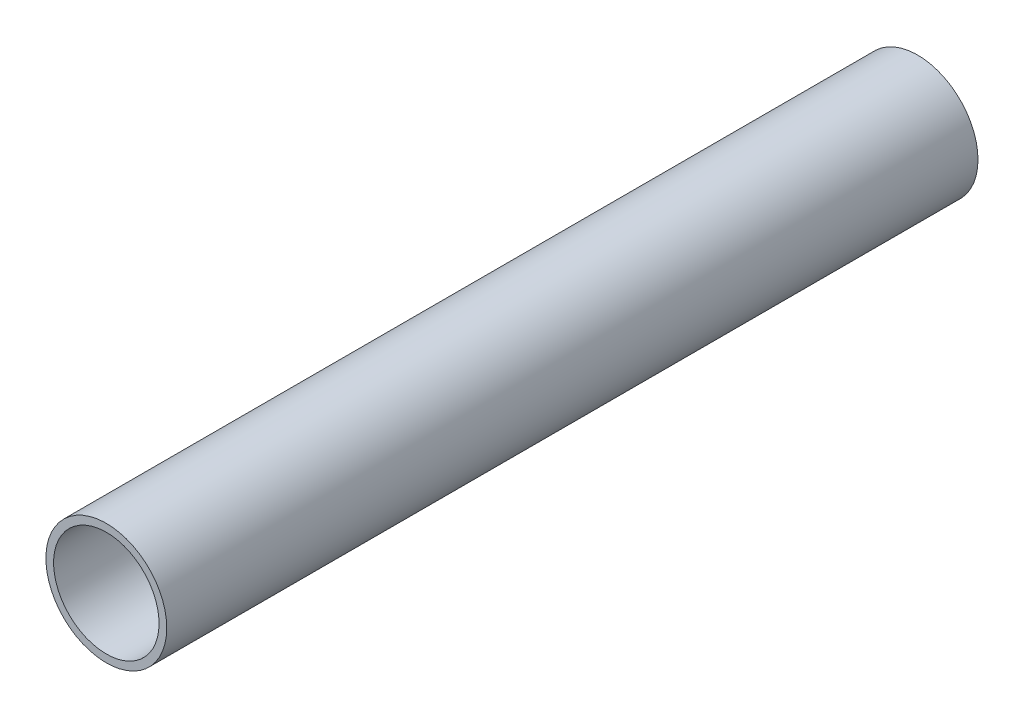
ISO-10303-21;
HEADER;
FILE_DESCRIPTION(('STEP AP214'),'2;1');
FILE_NAME('part.step','',(''),(''),'','','');
FILE_SCHEMA(('AUTOMOTIVE_DESIGN { 1 0 10303 214 1 1 1 1 }'));
ENDSEC;
DATA;
#1=APPLICATION_CONTEXT('core data for automotive mechanical design processes');
#2=APPLICATION_PROTOCOL_DEFINITION('international standard','automotive_design',2000,#1);
#3=PRODUCT_CONTEXT('',#1,'mechanical');
#4=PRODUCT('Part','Part','',(#3));
#5=PRODUCT_RELATED_PRODUCT_CATEGORY('part','',(#4));
#6=PRODUCT_DEFINITION_FORMATION('','',#4);
#7=PRODUCT_DEFINITION_CONTEXT('part definition',#1,'design');
#8=PRODUCT_DEFINITION('design','',#6,#7);
#9=PRODUCT_DEFINITION_SHAPE('','',#8);
#10=(LENGTH_UNIT() NAMED_UNIT(*) SI_UNIT(.MILLI.,.METRE.));
#11=(NAMED_UNIT(*) PLANE_ANGLE_UNIT() SI_UNIT($,.RADIAN.));
#12=(NAMED_UNIT(*) SI_UNIT($,.STERADIAN.) SOLID_ANGLE_UNIT());
#13=UNCERTAINTY_MEASURE_WITH_UNIT(LENGTH_MEASURE(1.E-05),#10,'distance_accuracy_value','');
#14=(GEOMETRIC_REPRESENTATION_CONTEXT(3) GLOBAL_UNCERTAINTY_ASSIGNED_CONTEXT((#13)) GLOBAL_UNIT_ASSIGNED_CONTEXT((#10,
#11,#12)) REPRESENTATION_CONTEXT('',''));
#15=CARTESIAN_POINT('',(0.,0.,0.));
#16=DIRECTION('',(0.,0.,1.));
#17=DIRECTION('',(1.,0.,0.));
#18=AXIS2_PLACEMENT_3D('',#15,#16,#17);
#19=CARTESIAN_POINT('',(0.,0.,254.));
#20=DIRECTION('',(0.,0.,1.));
#21=DIRECTION('',(1.,0.,0.));
#22=AXIS2_PLACEMENT_3D('',#19,#20,#21);
#23=PLANE('',#22);
#24=CARTESIAN_POINT('',(0.,0.,254.));
#25=DIRECTION('',(0.,0.,1.));
#26=DIRECTION('',(1.,0.,0.));
#27=AXIS2_PLACEMENT_3D('',#24,#25,#26);
#28=CIRCLE('',#27,18.923);
#29=CARTESIAN_POINT('',(18.923,0.,254.));
#30=VERTEX_POINT('',#29);
#31=EDGE_CURVE('E10',#30,#30,#28,.T.);
#32=ORIENTED_EDGE('',*,*,#31,.T.);
#33=EDGE_LOOP('',(#32));
#34=FACE_BOUND('',#33,.T.);
#35=CARTESIAN_POINT('',(0.,0.,254.));
#36=DIRECTION('',(0.,0.,1.));
#37=DIRECTION('',(1.,0.,0.));
#38=AXIS2_PLACEMENT_3D('',#35,#36,#37);
#39=CIRCLE('',#38,16.51);
#40=CARTESIAN_POINT('',(16.51,0.,254.));
#41=VERTEX_POINT('',#40);
#42=EDGE_CURVE('E42',#41,#41,#39,.T.);
#43=ORIENTED_EDGE('',*,*,#42,.F.);
#44=EDGE_LOOP('',(#43));
#45=FACE_BOUND('',#44,.T.);
#46=ADVANCED_FACE('F31',(#34,#45),#23,.T.);
#47=CARTESIAN_POINT('',(0.,0.,0.));
#48=DIRECTION('',(0.,0.,1.));
#49=DIRECTION('',(1.,0.,0.));
#50=AXIS2_PLACEMENT_3D('',#47,#48,#49);
#51=PLANE('',#50);
#52=CARTESIAN_POINT('',(0.,0.,0.));
#53=DIRECTION('',(0.,0.,1.));
#54=DIRECTION('',(1.,0.,0.));
#55=AXIS2_PLACEMENT_3D('',#52,#53,#54);
#56=CIRCLE('',#55,18.923);
#57=CARTESIAN_POINT('',(18.923,0.,0.));
#58=VERTEX_POINT('',#57);
#59=EDGE_CURVE('E35',#58,#58,#56,.T.);
#60=ORIENTED_EDGE('',*,*,#59,.F.);
#61=EDGE_LOOP('',(#60));
#62=FACE_BOUND('',#61,.T.);
#63=CARTESIAN_POINT('',(0.,0.,0.));
#64=DIRECTION('',(0.,0.,1.));
#65=DIRECTION('',(1.,0.,0.));
#66=AXIS2_PLACEMENT_3D('',#63,#64,#65);
#67=CIRCLE('',#66,16.51);
#68=CARTESIAN_POINT('',(16.51,0.,0.));
#69=VERTEX_POINT('',#68);
#70=EDGE_CURVE('E44',#69,#69,#67,.T.);
#71=ORIENTED_EDGE('',*,*,#70,.T.);
#72=EDGE_LOOP('',(#71));
#73=FACE_BOUND('',#72,.T.);
#74=ADVANCED_FACE('F54',(#62,#73),#51,.F.);
#75=CARTESIAN_POINT('',(0.,0.,254.));
#76=DIRECTION('',(0.,0.,-1.));
#77=DIRECTION('',(-1.,0.,0.));
#78=AXIS2_PLACEMENT_3D('',#75,#76,#77);
#79=CYLINDRICAL_SURFACE('',#78,18.923);
#80=ORIENTED_EDGE('',*,*,#31,.F.);
#81=EDGE_LOOP('',(#80));
#82=FACE_BOUND('',#81,.T.);
#83=ORIENTED_EDGE('',*,*,#59,.T.);
#84=EDGE_LOOP('',(#83));
#85=FACE_BOUND('',#84,.T.);
#86=ADVANCED_FACE('F33',(#82,#85),#79,.T.);
#87=CARTESIAN_POINT('',(0.,0.,254.));
#88=DIRECTION('',(0.,0.,-1.));
#89=DIRECTION('',(-1.,0.,0.));
#90=AXIS2_PLACEMENT_3D('',#87,#88,#89);
#91=CYLINDRICAL_SURFACE('',#90,16.51);
#92=ORIENTED_EDGE('',*,*,#42,.T.);
#93=EDGE_LOOP('',(#92));
#94=FACE_BOUND('',#93,.T.);
#95=ORIENTED_EDGE('',*,*,#70,.F.);
#96=EDGE_LOOP('',(#95));
#97=FACE_BOUND('',#96,.T.);
#98=ADVANCED_FACE('F50',(#94,#97),#91,.F.);
#99=CLOSED_SHELL('',(#46,#74,#86,#98));
#100=MANIFOLD_SOLID_BREP('B2',#99);
#101=ADVANCED_BREP_SHAPE_REPRESENTATION('',(#18,#100),#14);
#102=SHAPE_DEFINITION_REPRESENTATION(#9,#101);
ENDSEC;
END-ISO-10303-21;
